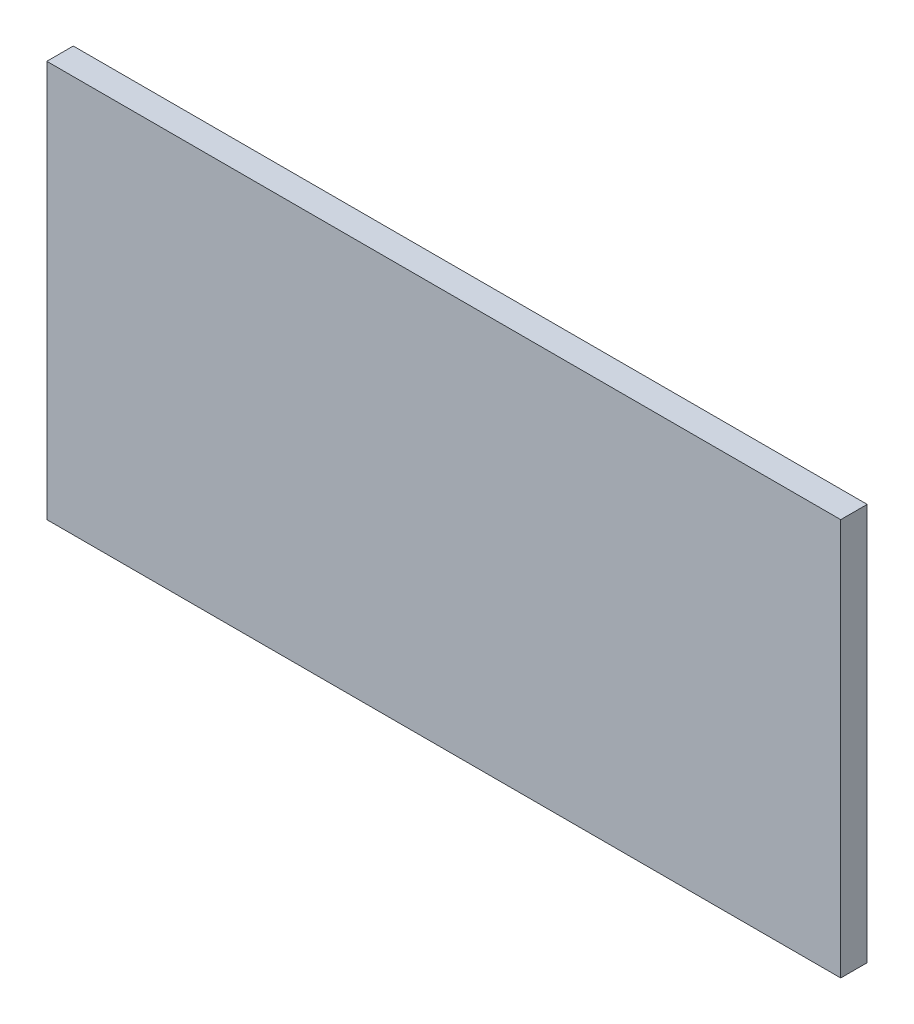
ISO-10303-21;
HEADER;
FILE_DESCRIPTION(('STEP AP214'),'2;1');
FILE_NAME('part.step','',(''),(''),'','','');
FILE_SCHEMA(('AUTOMOTIVE_DESIGN { 1 0 10303 214 1 1 1 1 }'));
ENDSEC;
DATA;
#1=APPLICATION_CONTEXT('core data for automotive mechanical design processes');
#2=APPLICATION_PROTOCOL_DEFINITION('international standard','automotive_design',2000,#1);
#3=PRODUCT_CONTEXT('',#1,'mechanical');
#4=PRODUCT('Part','Part','',(#3));
#5=PRODUCT_RELATED_PRODUCT_CATEGORY('part','',(#4));
#6=PRODUCT_DEFINITION_FORMATION('','',#4);
#7=PRODUCT_DEFINITION_CONTEXT('part definition',#1,'design');
#8=PRODUCT_DEFINITION('design','',#6,#7);
#9=PRODUCT_DEFINITION_SHAPE('','',#8);
#10=(LENGTH_UNIT() NAMED_UNIT(*) SI_UNIT(.MILLI.,.METRE.));
#11=(NAMED_UNIT(*) PLANE_ANGLE_UNIT() SI_UNIT($,.RADIAN.));
#12=(NAMED_UNIT(*) SI_UNIT($,.STERADIAN.) SOLID_ANGLE_UNIT());
#13=UNCERTAINTY_MEASURE_WITH_UNIT(LENGTH_MEASURE(1.E-05),#10,'distance_accuracy_value','');
#14=(GEOMETRIC_REPRESENTATION_CONTEXT(3) GLOBAL_UNCERTAINTY_ASSIGNED_CONTEXT((#13)) GLOBAL_UNIT_ASSIGNED_CONTEXT((#10,
#11,#12)) REPRESENTATION_CONTEXT('',''));
#15=CARTESIAN_POINT('',(0.,0.,0.));
#16=DIRECTION('',(0.,0.,1.));
#17=DIRECTION('',(1.,0.,0.));
#18=AXIS2_PLACEMENT_3D('',#15,#16,#17);
#19=CARTESIAN_POINT('',(0.,0.,-20.));
#20=DIRECTION('',(-1.,0.,0.));
#21=DIRECTION('',(0.,0.,1.));
#22=AXIS2_PLACEMENT_3D('',#19,#20,#21);
#23=PLANE('',#22);
#24=DIRECTION('',(0.,-1.,0.));
#25=VECTOR('',#24,1.);
#26=CARTESIAN_POINT('',(0.,0.,0.));
#27=LINE('',#26,#25);
#28=CARTESIAN_POINT('',(0.,300.,0.));
#29=VERTEX_POINT('',#28);
#30=CARTESIAN_POINT('',(0.,0.,0.));
#31=VERTEX_POINT('',#30);
#32=EDGE_CURVE('E102',#29,#31,#27,.T.);
#33=ORIENTED_EDGE('',*,*,#32,.F.);
#34=DIRECTION('',(0.,0.,1.));
#35=VECTOR('',#34,1.);
#36=CARTESIAN_POINT('',(0.,300.,-20.));
#37=LINE('',#36,#35);
#38=CARTESIAN_POINT('',(0.,300.,-20.));
#39=VERTEX_POINT('',#38);
#40=EDGE_CURVE('E11',#39,#29,#37,.T.);
#41=ORIENTED_EDGE('',*,*,#40,.F.);
#42=DIRECTION('',(0.,-1.,0.));
#43=VECTOR('',#42,1.);
#44=CARTESIAN_POINT('',(0.,0.,-20.));
#45=LINE('',#44,#43);
#46=CARTESIAN_POINT('',(0.,0.,-20.));
#47=VERTEX_POINT('',#46);
#48=EDGE_CURVE('E96',#39,#47,#45,.T.);
#49=ORIENTED_EDGE('',*,*,#48,.T.);
#50=DIRECTION('',(0.,0.,1.));
#51=VECTOR('',#50,1.);
#52=CARTESIAN_POINT('',(0.,0.,-20.));
#53=LINE('',#52,#51);
#54=EDGE_CURVE('E41',#47,#31,#53,.T.);
#55=ORIENTED_EDGE('',*,*,#54,.T.);
#56=EDGE_LOOP('',(#33,#41,#49,#55));
#57=FACE_BOUND('',#56,.T.);
#58=ADVANCED_FACE('F38',(#57),#23,.T.);
#59=CARTESIAN_POINT('',(0.,300.,-20.));
#60=DIRECTION('',(0.,1.,0.));
#61=DIRECTION('',(0.,0.,1.));
#62=AXIS2_PLACEMENT_3D('',#59,#60,#61);
#63=PLANE('',#62);
#64=DIRECTION('',(-1.,0.,0.));
#65=VECTOR('',#64,1.);
#66=CARTESIAN_POINT('',(0.,300.,0.));
#67=LINE('',#66,#65);
#68=CARTESIAN_POINT('',(600.,300.,0.));
#69=VERTEX_POINT('',#68);
#70=EDGE_CURVE('E98',#69,#29,#67,.T.);
#71=ORIENTED_EDGE('',*,*,#70,.F.);
#72=DIRECTION('',(0.,0.,1.));
#73=VECTOR('',#72,1.);
#74=CARTESIAN_POINT('',(600.,300.,-20.));
#75=LINE('',#74,#73);
#76=CARTESIAN_POINT('',(600.,300.,-20.));
#77=VERTEX_POINT('',#76);
#78=EDGE_CURVE('E47',#77,#69,#75,.T.);
#79=ORIENTED_EDGE('',*,*,#78,.F.);
#80=DIRECTION('',(-1.,0.,0.));
#81=VECTOR('',#80,1.);
#82=CARTESIAN_POINT('',(0.,300.,-20.));
#83=LINE('',#82,#81);
#84=EDGE_CURVE('E93',#77,#39,#83,.T.);
#85=ORIENTED_EDGE('',*,*,#84,.T.);
#86=ORIENTED_EDGE('',*,*,#40,.T.);
#87=EDGE_LOOP('',(#71,#79,#85,#86));
#88=FACE_BOUND('',#87,.T.);
#89=ADVANCED_FACE('F112',(#88),#63,.T.);
#90=CARTESIAN_POINT('',(600.,0.,-20.));
#91=DIRECTION('',(1.,0.,0.));
#92=DIRECTION('',(0.,0.,-1.));
#93=AXIS2_PLACEMENT_3D('',#90,#91,#92);
#94=PLANE('',#93);
#95=DIRECTION('',(0.,1.,0.));
#96=VECTOR('',#95,1.);
#97=CARTESIAN_POINT('',(600.,0.,0.));
#98=LINE('',#97,#96);
#99=CARTESIAN_POINT('',(600.,0.,0.));
#100=VERTEX_POINT('',#99);
#101=EDGE_CURVE('E88',#100,#69,#98,.T.);
#102=ORIENTED_EDGE('',*,*,#101,.F.);
#103=DIRECTION('',(0.,0.,1.));
#104=VECTOR('',#103,1.);
#105=CARTESIAN_POINT('',(600.,0.,-20.));
#106=LINE('',#105,#104);
#107=CARTESIAN_POINT('',(600.,0.,-20.));
#108=VERTEX_POINT('',#107);
#109=EDGE_CURVE('E83',#108,#100,#106,.T.);
#110=ORIENTED_EDGE('',*,*,#109,.F.);
#111=DIRECTION('',(0.,1.,0.));
#112=VECTOR('',#111,1.);
#113=CARTESIAN_POINT('',(600.,0.,-20.));
#114=LINE('',#113,#112);
#115=EDGE_CURVE('E86',#108,#77,#114,.T.);
#116=ORIENTED_EDGE('',*,*,#115,.T.);
#117=ORIENTED_EDGE('',*,*,#78,.T.);
#118=EDGE_LOOP('',(#102,#110,#116,#117));
#119=FACE_BOUND('',#118,.T.);
#120=ADVANCED_FACE('F85',(#119),#94,.T.);
#121=CARTESIAN_POINT('',(0.,0.,-20.));
#122=DIRECTION('',(0.,-1.,0.));
#123=DIRECTION('',(0.,0.,-1.));
#124=AXIS2_PLACEMENT_3D('',#121,#122,#123);
#125=PLANE('',#124);
#126=DIRECTION('',(1.,0.,0.));
#127=VECTOR('',#126,1.);
#128=CARTESIAN_POINT('',(0.,0.,0.));
#129=LINE('',#128,#127);
#130=EDGE_CURVE('E105',#31,#100,#129,.T.);
#131=ORIENTED_EDGE('',*,*,#130,.F.);
#132=ORIENTED_EDGE('',*,*,#54,.F.);
#133=DIRECTION('',(1.,0.,0.));
#134=VECTOR('',#133,1.);
#135=CARTESIAN_POINT('',(0.,0.,-20.));
#136=LINE('',#135,#134);
#137=EDGE_CURVE('E92',#47,#108,#136,.T.);
#138=ORIENTED_EDGE('',*,*,#137,.T.);
#139=ORIENTED_EDGE('',*,*,#109,.T.);
#140=EDGE_LOOP('',(#131,#132,#138,#139));
#141=FACE_BOUND('',#140,.T.);
#142=ADVANCED_FACE('F95',(#141),#125,.T.);
#143=CARTESIAN_POINT('',(0.,0.,-20.));
#144=DIRECTION('',(0.,0.,-1.));
#145=DIRECTION('',(-1.,0.,0.));
#146=AXIS2_PLACEMENT_3D('',#143,#144,#145);
#147=PLANE('',#146);
#148=ORIENTED_EDGE('',*,*,#48,.F.);
#149=ORIENTED_EDGE('',*,*,#84,.F.);
#150=ORIENTED_EDGE('',*,*,#115,.F.);
#151=ORIENTED_EDGE('',*,*,#137,.F.);
#152=EDGE_LOOP('',(#148,#149,#150,#151));
#153=FACE_BOUND('',#152,.T.);
#154=ADVANCED_FACE('F91',(#153),#147,.T.);
#155=CARTESIAN_POINT('',(0.,0.,0.));
#156=DIRECTION('',(0.,0.,-1.));
#157=DIRECTION('',(-1.,0.,0.));
#158=AXIS2_PLACEMENT_3D('',#155,#156,#157);
#159=PLANE('',#158);
#160=ORIENTED_EDGE('',*,*,#32,.T.);
#161=ORIENTED_EDGE('',*,*,#130,.T.);
#162=ORIENTED_EDGE('',*,*,#101,.T.);
#163=ORIENTED_EDGE('',*,*,#70,.T.);
#164=EDGE_LOOP('',(#160,#161,#162,#163));
#165=FACE_BOUND('',#164,.T.);
#166=ADVANCED_FACE('F111',(#165),#159,.F.);
#167=CLOSED_SHELL('',(#58,#89,#120,#142,#154,#166));
#168=MANIFOLD_SOLID_BREP('B2',#167);
#169=ADVANCED_BREP_SHAPE_REPRESENTATION('',(#18,#168),#14);
#170=SHAPE_DEFINITION_REPRESENTATION(#9,#169);
ENDSEC;
END-ISO-10303-21;
